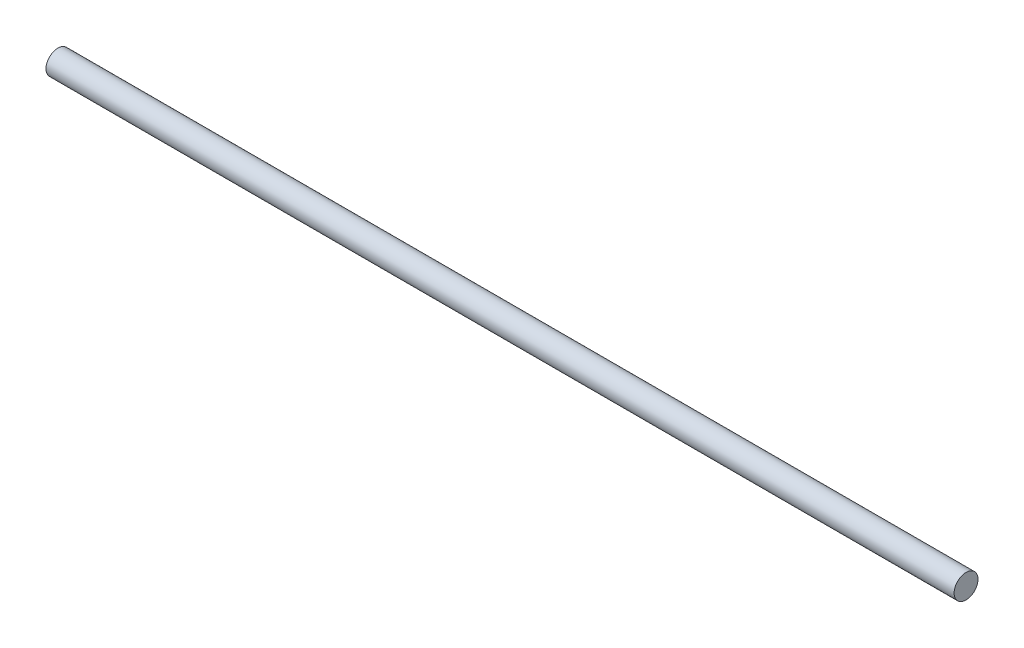
ISO-10303-21;
HEADER;
FILE_DESCRIPTION(('STEP AP214'),'2;1');
FILE_NAME('part.step','',(''),(''),'','','');
FILE_SCHEMA(('AUTOMOTIVE_DESIGN { 1 0 10303 214 1 1 1 1 }'));
ENDSEC;
DATA;
#1=APPLICATION_CONTEXT('core data for automotive mechanical design processes');
#2=APPLICATION_PROTOCOL_DEFINITION('international standard','automotive_design',2000,#1);
#3=PRODUCT_CONTEXT('',#1,'mechanical');
#4=PRODUCT('Part','Part','',(#3));
#5=PRODUCT_RELATED_PRODUCT_CATEGORY('part','',(#4));
#6=PRODUCT_DEFINITION_FORMATION('','',#4);
#7=PRODUCT_DEFINITION_CONTEXT('part definition',#1,'design');
#8=PRODUCT_DEFINITION('design','',#6,#7);
#9=PRODUCT_DEFINITION_SHAPE('','',#8);
#10=(LENGTH_UNIT() NAMED_UNIT(*) SI_UNIT(.MILLI.,.METRE.));
#11=(NAMED_UNIT(*) PLANE_ANGLE_UNIT() SI_UNIT($,.RADIAN.));
#12=(NAMED_UNIT(*) SI_UNIT($,.STERADIAN.) SOLID_ANGLE_UNIT());
#13=UNCERTAINTY_MEASURE_WITH_UNIT(LENGTH_MEASURE(1.E-05),#10,'distance_accuracy_value','');
#14=(GEOMETRIC_REPRESENTATION_CONTEXT(3) GLOBAL_UNCERTAINTY_ASSIGNED_CONTEXT((#13)) GLOBAL_UNIT_ASSIGNED_CONTEXT((#10,
#11,#12)) REPRESENTATION_CONTEXT('',''));
#15=CARTESIAN_POINT('',(0.,0.,0.));
#16=DIRECTION('',(0.,0.,1.));
#17=DIRECTION('',(1.,0.,0.));
#18=AXIS2_PLACEMENT_3D('',#15,#16,#17);
#19=CARTESIAN_POINT('',(152.,0.,0.));
#20=DIRECTION('',(-1.,0.,0.));
#21=DIRECTION('',(0.,0.,1.));
#22=AXIS2_PLACEMENT_3D('',#19,#20,#21);
#23=CYLINDRICAL_SURFACE('',#22,4.);
#24=CARTESIAN_POINT('',(152.,0.,0.));
#25=DIRECTION('',(1.,0.,0.));
#26=DIRECTION('',(0.,0.,-1.));
#27=AXIS2_PLACEMENT_3D('',#24,#25,#26);
#28=CIRCLE('',#27,4.);
#29=CARTESIAN_POINT('',(152.,0.,-4.));
#30=VERTEX_POINT('',#29);
#31=EDGE_CURVE('E10',#30,#30,#28,.T.);
#32=ORIENTED_EDGE('',*,*,#31,.F.);
#33=EDGE_LOOP('',(#32));
#34=FACE_BOUND('',#33,.T.);
#35=CARTESIAN_POINT('',(-152.,0.,0.));
#36=DIRECTION('',(1.,0.,0.));
#37=DIRECTION('',(0.,0.,-1.));
#38=AXIS2_PLACEMENT_3D('',#35,#36,#37);
#39=CIRCLE('',#38,4.);
#40=CARTESIAN_POINT('',(-152.,0.,-4.));
#41=VERTEX_POINT('',#40);
#42=EDGE_CURVE('E34',#41,#41,#39,.T.);
#43=ORIENTED_EDGE('',*,*,#42,.T.);
#44=EDGE_LOOP('',(#43));
#45=FACE_BOUND('',#44,.T.);
#46=ADVANCED_FACE('F31',(#34,#45),#23,.T.);
#47=CARTESIAN_POINT('',(152.,0.,0.));
#48=DIRECTION('',(1.,0.,0.));
#49=DIRECTION('',(0.,0.,-1.));
#50=AXIS2_PLACEMENT_3D('',#47,#48,#49);
#51=PLANE('',#50);
#52=ORIENTED_EDGE('',*,*,#31,.T.);
#53=EDGE_LOOP('',(#52));
#54=FACE_BOUND('',#53,.T.);
#55=ADVANCED_FACE('F46',(#54),#51,.T.);
#56=CARTESIAN_POINT('',(-152.,0.,0.));
#57=DIRECTION('',(1.,0.,0.));
#58=DIRECTION('',(0.,0.,-1.));
#59=AXIS2_PLACEMENT_3D('',#56,#57,#58);
#60=PLANE('',#59);
#61=ORIENTED_EDGE('',*,*,#42,.F.);
#62=EDGE_LOOP('',(#61));
#63=FACE_BOUND('',#62,.T.);
#64=ADVANCED_FACE('F44',(#63),#60,.F.);
#65=CLOSED_SHELL('',(#46,#55,#64));
#66=MANIFOLD_SOLID_BREP('B2',#65);
#67=ADVANCED_BREP_SHAPE_REPRESENTATION('',(#18,#66),#14);
#68=SHAPE_DEFINITION_REPRESENTATION(#9,#67);
ENDSEC;
END-ISO-10303-21;
